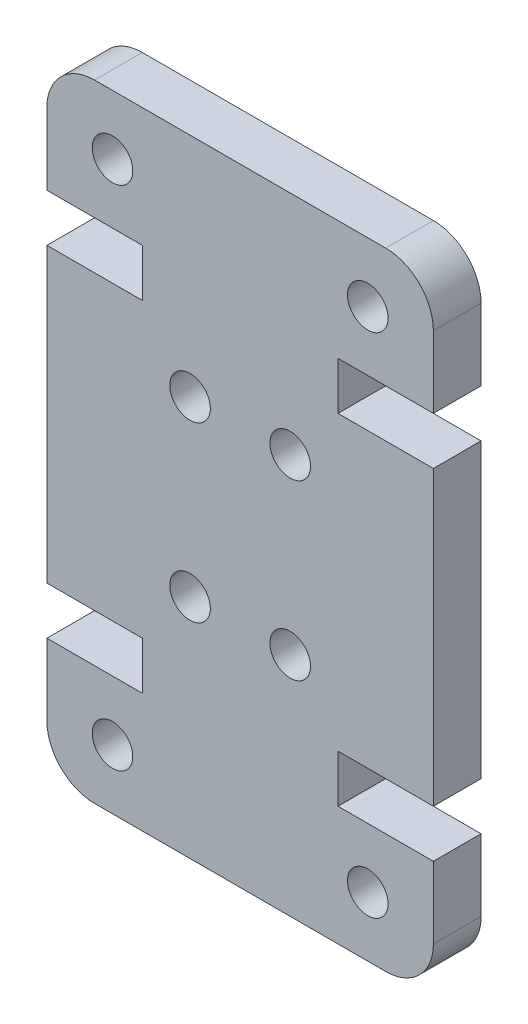
ISO-10303-21;
HEADER;
FILE_DESCRIPTION(('STEP AP214'),'2;1');
FILE_NAME('part.step','',(''),(''),'','','');
FILE_SCHEMA(('AUTOMOTIVE_DESIGN { 1 0 10303 214 1 1 1 1 }'));
ENDSEC;
DATA;
#1=APPLICATION_CONTEXT('core data for automotive mechanical design processes');
#2=APPLICATION_PROTOCOL_DEFINITION('international standard','automotive_design',2000,#1);
#3=PRODUCT_CONTEXT('',#1,'mechanical');
#4=PRODUCT('Part','Part','',(#3));
#5=PRODUCT_RELATED_PRODUCT_CATEGORY('part','',(#4));
#6=PRODUCT_DEFINITION_FORMATION('','',#4);
#7=PRODUCT_DEFINITION_CONTEXT('part definition',#1,'design');
#8=PRODUCT_DEFINITION('design','',#6,#7);
#9=PRODUCT_DEFINITION_SHAPE('','',#8);
#10=(LENGTH_UNIT() NAMED_UNIT(*) SI_UNIT(.MILLI.,.METRE.));
#11=(NAMED_UNIT(*) PLANE_ANGLE_UNIT() SI_UNIT($,.RADIAN.));
#12=(NAMED_UNIT(*) SI_UNIT($,.STERADIAN.) SOLID_ANGLE_UNIT());
#13=UNCERTAINTY_MEASURE_WITH_UNIT(LENGTH_MEASURE(1.E-05),#10,'distance_accuracy_value','');
#14=(GEOMETRIC_REPRESENTATION_CONTEXT(3) GLOBAL_UNCERTAINTY_ASSIGNED_CONTEXT((#13)) GLOBAL_UNIT_ASSIGNED_CONTEXT((#10,
#11,#12)) REPRESENTATION_CONTEXT('',''));
#15=CARTESIAN_POINT('',(0.,0.,0.));
#16=DIRECTION('',(0.,0.,1.));
#17=DIRECTION('',(1.,0.,0.));
#18=AXIS2_PLACEMENT_3D('',#15,#16,#17);
#19=CARTESIAN_POINT('',(14.2,2.,0.));
#20=DIRECTION('',(0.,0.,-1.));
#21=DIRECTION('',(-1.,0.,0.));
#22=AXIS2_PLACEMENT_3D('',#19,#20,#21);
#23=PLANE('',#22);
#24=CARTESIAN_POINT('',(6.00000000000001,9.49999999999963,0.));
#25=DIRECTION('',(0.,0.,1.));
#26=DIRECTION('',(1.,0.,0.));
#27=AXIS2_PLACEMENT_3D('',#24,#25,#26);
#28=CIRCLE('',#27,0.85);
#29=CARTESIAN_POINT('',(6.85,9.49999999999963,0.));
#30=VERTEX_POINT('',#29);
#31=EDGE_CURVE('E359',#30,#30,#28,.T.);
#32=ORIENTED_EDGE('',*,*,#31,.T.);
#33=EDGE_LOOP('',(#32));
#34=FACE_BOUND('',#33,.T.);
#35=CARTESIAN_POINT('',(10.2,16.7600000000004,0.));
#36=DIRECTION('',(0.,0.,1.));
#37=DIRECTION('',(1.,0.,0.));
#38=AXIS2_PLACEMENT_3D('',#35,#36,#37);
#39=CIRCLE('',#38,0.85);
#40=CARTESIAN_POINT('',(11.05,16.7600000000004,0.));
#41=VERTEX_POINT('',#40);
#42=EDGE_CURVE('E353',#41,#41,#39,.T.);
#43=ORIENTED_EDGE('',*,*,#42,.T.);
#44=EDGE_LOOP('',(#43));
#45=FACE_BOUND('',#44,.T.);
#46=CARTESIAN_POINT('',(2.75000000000002,23.7599999999998,0.));
#47=DIRECTION('',(0.,0.,1.));
#48=DIRECTION('',(-1.,0.,0.));
#49=AXIS2_PLACEMENT_3D('',#46,#47,#48);
#50=CIRCLE('',#49,0.85);
#51=CARTESIAN_POINT('',(1.90000000000003,23.7599999999998,0.));
#52=VERTEX_POINT('',#51);
#53=EDGE_CURVE('E347',#52,#52,#50,.T.);
#54=ORIENTED_EDGE('',*,*,#53,.T.);
#55=EDGE_LOOP('',(#54));
#56=FACE_BOUND('',#55,.T.);
#57=CARTESIAN_POINT('',(13.45,2.50000000000017,0.));
#58=DIRECTION('',(0.,0.,1.));
#59=DIRECTION('',(-1.,0.,0.));
#60=AXIS2_PLACEMENT_3D('',#57,#58,#59);
#61=CIRCLE('',#60,0.85);
#62=CARTESIAN_POINT('',(12.6,2.50000000000017,0.));
#63=VERTEX_POINT('',#62);
#64=EDGE_CURVE('E340',#63,#63,#61,.T.);
#65=ORIENTED_EDGE('',*,*,#64,.T.);
#66=EDGE_LOOP('',(#65));
#67=FACE_BOUND('',#66,.T.);
#68=CARTESIAN_POINT('',(14.2,2.,0.));
#69=DIRECTION('',(0.,0.,1.));
#70=DIRECTION('',(-1.,0.,0.));
#71=AXIS2_PLACEMENT_3D('',#68,#69,#70);
#72=CIRCLE('',#71,2.);
#73=CARTESIAN_POINT('',(14.2,0.,0.));
#74=VERTEX_POINT('',#73);
#75=CARTESIAN_POINT('',(16.2,2.,0.));
#76=VERTEX_POINT('',#75);
#77=EDGE_CURVE('E271',#74,#76,#72,.T.);
#78=ORIENTED_EDGE('',*,*,#77,.F.);
#79=DIRECTION('',(1.,0.,0.));
#80=VECTOR('',#79,1.);
#81=CARTESIAN_POINT('',(2.,0.,0.));
#82=LINE('',#81,#80);
#83=CARTESIAN_POINT('',(2.,0.,0.));
#84=VERTEX_POINT('',#83);
#85=EDGE_CURVE('E207',#84,#74,#82,.T.);
#86=ORIENTED_EDGE('',*,*,#85,.F.);
#87=CARTESIAN_POINT('',(2.,2.,0.));
#88=DIRECTION('',(0.,0.,1.));
#89=DIRECTION('',(1.,0.,0.));
#90=AXIS2_PLACEMENT_3D('',#87,#88,#89);
#91=CIRCLE('',#90,2.);
#92=CARTESIAN_POINT('',(0.,2.,0.));
#93=VERTEX_POINT('',#92);
#94=EDGE_CURVE('E213',#93,#84,#91,.T.);
#95=ORIENTED_EDGE('',*,*,#94,.F.);
#96=DIRECTION('',(0.,-1.,0.));
#97=VECTOR('',#96,1.);
#98=CARTESIAN_POINT('',(0.,2.,0.));
#99=LINE('',#98,#97);
#100=CARTESIAN_POINT('',(0.,4.99999999999945,0.));
#101=VERTEX_POINT('',#100);
#102=EDGE_CURVE('E332',#101,#93,#99,.T.);
#103=ORIENTED_EDGE('',*,*,#102,.F.);
#104=DIRECTION('',(-1.,0.,0.));
#105=VECTOR('',#104,1.);
#106=CARTESIAN_POINT('',(4.,4.99999999999945,0.));
#107=LINE('',#106,#105);
#108=CARTESIAN_POINT('',(4.,4.99999999999945,0.));
#109=VERTEX_POINT('',#108);
#110=EDGE_CURVE('E329',#109,#101,#107,.T.);
#111=ORIENTED_EDGE('',*,*,#110,.F.);
#112=DIRECTION('',(0.,-1.,0.));
#113=VECTOR('',#112,1.);
#114=CARTESIAN_POINT('',(4.,6.99999999999945,0.));
#115=LINE('',#114,#113);
#116=CARTESIAN_POINT('',(4.,6.99999999999945,0.));
#117=VERTEX_POINT('',#116);
#118=EDGE_CURVE('E326',#117,#109,#115,.T.);
#119=ORIENTED_EDGE('',*,*,#118,.F.);
#120=DIRECTION('',(1.,0.,0.));
#121=VECTOR('',#120,1.);
#122=CARTESIAN_POINT('',(0.,6.99999999999945,0.));
#123=LINE('',#122,#121);
#124=CARTESIAN_POINT('',(0.,6.99999999999945,0.));
#125=VERTEX_POINT('',#124);
#126=EDGE_CURVE('E323',#125,#117,#123,.T.);
#127=ORIENTED_EDGE('',*,*,#126,.F.);
#128=DIRECTION('',(0.,-1.,0.));
#129=VECTOR('',#128,1.);
#130=CARTESIAN_POINT('',(0.,6.99999999999945,0.));
#131=LINE('',#130,#129);
#132=CARTESIAN_POINT('',(0.,19.2600000000005,0.));
#133=VERTEX_POINT('',#132);
#134=EDGE_CURVE('E320',#133,#125,#131,.T.);
#135=ORIENTED_EDGE('',*,*,#134,.F.);
#136=DIRECTION('',(-1.,0.,0.));
#137=VECTOR('',#136,1.);
#138=CARTESIAN_POINT('',(0.,19.2600000000005,0.));
#139=LINE('',#138,#137);
#140=CARTESIAN_POINT('',(4.,19.2600000000005,0.));
#141=VERTEX_POINT('',#140);
#142=EDGE_CURVE('E317',#141,#133,#139,.T.);
#143=ORIENTED_EDGE('',*,*,#142,.F.);
#144=DIRECTION('',(0.,-1.,0.));
#145=VECTOR('',#144,1.);
#146=CARTESIAN_POINT('',(4.,19.2600000000005,0.));
#147=LINE('',#146,#145);
#148=CARTESIAN_POINT('',(3.99999999999999,21.2600000000005,0.));
#149=VERTEX_POINT('',#148);
#150=EDGE_CURVE('E314',#149,#141,#147,.T.);
#151=ORIENTED_EDGE('',*,*,#150,.F.);
#152=DIRECTION('',(1.,0.,0.));
#153=VECTOR('',#152,1.);
#154=CARTESIAN_POINT('',(3.99999999999999,21.2600000000005,0.));
#155=LINE('',#154,#153);
#156=CARTESIAN_POINT('',(0.,21.2600000000005,0.));
#157=VERTEX_POINT('',#156);
#158=EDGE_CURVE('E311',#157,#149,#155,.T.);
#159=ORIENTED_EDGE('',*,*,#158,.F.);
#160=DIRECTION('',(0.,-1.,0.));
#161=VECTOR('',#160,1.);
#162=CARTESIAN_POINT('',(0.,24.26,0.));
#163=LINE('',#162,#161);
#164=CARTESIAN_POINT('',(0.,24.26,0.));
#165=VERTEX_POINT('',#164);
#166=EDGE_CURVE('E308',#165,#157,#163,.T.);
#167=ORIENTED_EDGE('',*,*,#166,.F.);
#168=CARTESIAN_POINT('',(2.,24.26,0.));
#169=DIRECTION('',(0.,0.,1.));
#170=DIRECTION('',(-1.,0.,0.));
#171=AXIS2_PLACEMENT_3D('',#168,#169,#170);
#172=CIRCLE('',#171,2.);
#173=CARTESIAN_POINT('',(1.99999999999999,26.26,0.));
#174=VERTEX_POINT('',#173);
#175=EDGE_CURVE('E305',#174,#165,#172,.T.);
#176=ORIENTED_EDGE('',*,*,#175,.F.);
#177=DIRECTION('',(-1.,0.,0.));
#178=VECTOR('',#177,1.);
#179=CARTESIAN_POINT('',(1.99999999999999,26.26,0.));
#180=LINE('',#179,#178);
#181=CARTESIAN_POINT('',(14.2,26.26,0.));
#182=VERTEX_POINT('',#181);
#183=EDGE_CURVE('E302',#182,#174,#180,.T.);
#184=ORIENTED_EDGE('',*,*,#183,.F.);
#185=CARTESIAN_POINT('',(14.2,24.26,0.));
#186=DIRECTION('',(0.,0.,1.));
#187=DIRECTION('',(1.,0.,0.));
#188=AXIS2_PLACEMENT_3D('',#185,#186,#187);
#189=CIRCLE('',#188,2.);
#190=CARTESIAN_POINT('',(16.2,24.26,0.));
#191=VERTEX_POINT('',#190);
#192=EDGE_CURVE('E299',#191,#182,#189,.T.);
#193=ORIENTED_EDGE('',*,*,#192,.F.);
#194=DIRECTION('',(0.,1.,0.));
#195=VECTOR('',#194,1.);
#196=CARTESIAN_POINT('',(16.2,24.26,0.));
#197=LINE('',#196,#195);
#198=CARTESIAN_POINT('',(16.2,21.2600000000005,0.));
#199=VERTEX_POINT('',#198);
#200=EDGE_CURVE('E296',#199,#191,#197,.T.);
#201=ORIENTED_EDGE('',*,*,#200,.F.);
#202=DIRECTION('',(1.,0.,0.));
#203=VECTOR('',#202,1.);
#204=CARTESIAN_POINT('',(12.2,21.2600000000005,0.));
#205=LINE('',#204,#203);
#206=CARTESIAN_POINT('',(12.2,21.2600000000005,0.));
#207=VERTEX_POINT('',#206);
#208=EDGE_CURVE('E293',#207,#199,#205,.T.);
#209=ORIENTED_EDGE('',*,*,#208,.F.);
#210=DIRECTION('',(0.,1.,0.));
#211=VECTOR('',#210,1.);
#212=CARTESIAN_POINT('',(12.2,19.2600000000005,0.));
#213=LINE('',#212,#211);
#214=CARTESIAN_POINT('',(12.2,19.2600000000005,0.));
#215=VERTEX_POINT('',#214);
#216=EDGE_CURVE('E290',#215,#207,#213,.T.);
#217=ORIENTED_EDGE('',*,*,#216,.F.);
#218=DIRECTION('',(-1.,0.,0.));
#219=VECTOR('',#218,1.);
#220=CARTESIAN_POINT('',(16.2,19.2600000000005,0.));
#221=LINE('',#220,#219);
#222=CARTESIAN_POINT('',(16.2,19.2600000000005,0.));
#223=VERTEX_POINT('',#222);
#224=EDGE_CURVE('E287',#223,#215,#221,.T.);
#225=ORIENTED_EDGE('',*,*,#224,.F.);
#226=DIRECTION('',(0.,1.,0.));
#227=VECTOR('',#226,1.);
#228=CARTESIAN_POINT('',(16.2,6.99999999999945,0.));
#229=LINE('',#228,#227);
#230=CARTESIAN_POINT('',(16.2,6.99999999999945,0.));
#231=VERTEX_POINT('',#230);
#232=EDGE_CURVE('E284',#231,#223,#229,.T.);
#233=ORIENTED_EDGE('',*,*,#232,.F.);
#234=DIRECTION('',(1.,0.,0.));
#235=VECTOR('',#234,1.);
#236=CARTESIAN_POINT('',(16.2,6.99999999999945,0.));
#237=LINE('',#236,#235);
#238=CARTESIAN_POINT('',(12.2,6.99999999999945,0.));
#239=VERTEX_POINT('',#238);
#240=EDGE_CURVE('E278',#239,#231,#237,.T.);
#241=ORIENTED_EDGE('',*,*,#240,.F.);
#242=DIRECTION('',(0.,1.,0.));
#243=VECTOR('',#242,1.);
#244=CARTESIAN_POINT('',(12.2,6.99999999999945,0.));
#245=LINE('',#244,#243);
#246=CARTESIAN_POINT('',(12.2,4.99999999999945,0.));
#247=VERTEX_POINT('',#246);
#248=EDGE_CURVE('E276',#247,#239,#245,.T.);
#249=ORIENTED_EDGE('',*,*,#248,.F.);
#250=DIRECTION('',(-1.,0.,0.));
#251=VECTOR('',#250,1.);
#252=CARTESIAN_POINT('',(12.2,4.99999999999945,0.));
#253=LINE('',#252,#251);
#254=CARTESIAN_POINT('',(16.2,4.99999999999945,0.));
#255=VERTEX_POINT('',#254);
#256=EDGE_CURVE('E264',#255,#247,#253,.T.);
#257=ORIENTED_EDGE('',*,*,#256,.F.);
#258=DIRECTION('',(0.,1.,0.));
#259=VECTOR('',#258,1.);
#260=CARTESIAN_POINT('',(16.2,2.,0.));
#261=LINE('',#260,#259);
#262=EDGE_CURVE('E268',#76,#255,#261,.T.);
#263=ORIENTED_EDGE('',*,*,#262,.F.);
#264=EDGE_LOOP('',(#78,#86,#95,#103,#111,#119,#127,#135,#143,#151,#159,#167,#176,#184,#193,#201,
#209,#217,#225,#233,#241,#249,#257,#263));
#265=FACE_BOUND('',#264,.T.);
#266=CARTESIAN_POINT('',(10.2,9.49999999999963,0.));
#267=DIRECTION('',(0.,0.,1.));
#268=DIRECTION('',(-1.,0.,0.));
#269=AXIS2_PLACEMENT_3D('',#266,#267,#268);
#270=CIRCLE('',#269,0.85);
#271=CARTESIAN_POINT('',(9.34999999999999,9.49999999999963,0.));
#272=VERTEX_POINT('',#271);
#273=EDGE_CURVE('E342',#272,#272,#270,.T.);
#274=ORIENTED_EDGE('',*,*,#273,.T.);
#275=EDGE_LOOP('',(#274));
#276=FACE_BOUND('',#275,.T.);
#277=CARTESIAN_POINT('',(6.,16.7600000000004,0.));
#278=DIRECTION('',(0.,0.,1.));
#279=DIRECTION('',(-1.,0.,0.));
#280=AXIS2_PLACEMENT_3D('',#277,#278,#279);
#281=CIRCLE('',#280,0.85);
#282=CARTESIAN_POINT('',(5.15,16.7600000000004,0.));
#283=VERTEX_POINT('',#282);
#284=EDGE_CURVE('E350',#283,#283,#281,.T.);
#285=ORIENTED_EDGE('',*,*,#284,.T.);
#286=EDGE_LOOP('',(#285));
#287=FACE_BOUND('',#286,.T.);
#288=CARTESIAN_POINT('',(13.45,23.7599999999998,0.));
#289=DIRECTION('',(0.,0.,1.));
#290=DIRECTION('',(1.,0.,0.));
#291=AXIS2_PLACEMENT_3D('',#288,#289,#290);
#292=CIRCLE('',#291,0.85);
#293=CARTESIAN_POINT('',(14.3,23.7599999999998,0.));
#294=VERTEX_POINT('',#293);
#295=EDGE_CURVE('E356',#294,#294,#292,.T.);
#296=ORIENTED_EDGE('',*,*,#295,.T.);
#297=EDGE_LOOP('',(#296));
#298=FACE_BOUND('',#297,.T.);
#299=CARTESIAN_POINT('',(2.75000000000003,2.50000000000017,0.));
#300=DIRECTION('',(0.,0.,1.));
#301=DIRECTION('',(1.,0.,0.));
#302=AXIS2_PLACEMENT_3D('',#299,#300,#301);
#303=CIRCLE('',#302,0.85);
#304=CARTESIAN_POINT('',(3.60000000000003,2.50000000000017,0.));
#305=VERTEX_POINT('',#304);
#306=EDGE_CURVE('E202',#305,#305,#303,.T.);
#307=ORIENTED_EDGE('',*,*,#306,.T.);
#308=EDGE_LOOP('',(#307));
#309=FACE_BOUND('',#308,.T.);
#310=ADVANCED_FACE('F33',(#34,#45,#56,#67,#265,#276,#287,#298,#309),#23,.T.);
#311=CARTESIAN_POINT('',(14.2,2.,4.));
#312=DIRECTION('',(0.,0.,-1.));
#313=DIRECTION('',(-1.,0.,0.));
#314=AXIS2_PLACEMENT_3D('',#311,#312,#313);
#315=CYLINDRICAL_SURFACE('',#314,2.);
#316=DIRECTION('',(0.,0.,-1.));
#317=VECTOR('',#316,1.);
#318=CARTESIAN_POINT('',(16.2,2.,4.));
#319=LINE('',#318,#317);
#320=CARTESIAN_POINT('',(16.2,2.00000000000001,2.));
#321=VERTEX_POINT('',#320);
#322=EDGE_CURVE('E11',#321,#76,#319,.T.);
#323=ORIENTED_EDGE('',*,*,#322,.F.);
#324=CARTESIAN_POINT('',(14.2,2.,2.));
#325=DIRECTION('',(0.,0.,-1.));
#326=DIRECTION('',(-1.,0.,0.));
#327=AXIS2_PLACEMENT_3D('',#324,#325,#326);
#328=CIRCLE('',#327,2.);
#329=CARTESIAN_POINT('',(14.2,0.,2.));
#330=VERTEX_POINT('',#329);
#331=EDGE_CURVE('E195',#321,#330,#328,.T.);
#332=ORIENTED_EDGE('',*,*,#331,.T.);
#333=DIRECTION('',(0.,0.,-1.));
#334=VECTOR('',#333,1.);
#335=CARTESIAN_POINT('',(14.2,0.,4.));
#336=LINE('',#335,#334);
#337=EDGE_CURVE('E57',#330,#74,#336,.T.);
#338=ORIENTED_EDGE('',*,*,#337,.T.);
#339=ORIENTED_EDGE('',*,*,#77,.T.);
#340=EDGE_LOOP('',(#323,#332,#338,#339));
#341=FACE_BOUND('',#340,.T.);
#342=ADVANCED_FACE('F35',(#341),#315,.T.);
#343=CARTESIAN_POINT('',(16.2,2.,4.));
#344=DIRECTION('',(-1.,0.,0.));
#345=DIRECTION('',(0.,0.,1.));
#346=AXIS2_PLACEMENT_3D('',#343,#344,#345);
#347=PLANE('',#346);
#348=DIRECTION('',(0.,0.,-1.));
#349=VECTOR('',#348,1.);
#350=CARTESIAN_POINT('',(16.2,4.99999999999945,4.));
#351=LINE('',#350,#349);
#352=CARTESIAN_POINT('',(16.2,4.99999999999945,2.));
#353=VERTEX_POINT('',#352);
#354=EDGE_CURVE('E42',#353,#255,#351,.T.);
#355=ORIENTED_EDGE('',*,*,#354,.F.);
#356=DIRECTION('',(0.,1.,0.));
#357=VECTOR('',#356,1.);
#358=CARTESIAN_POINT('',(16.2,26.26,2.));
#359=LINE('',#358,#357);
#360=EDGE_CURVE('E432',#321,#353,#359,.T.);
#361=ORIENTED_EDGE('',*,*,#360,.F.);
#362=ORIENTED_EDGE('',*,*,#322,.T.);
#363=ORIENTED_EDGE('',*,*,#262,.T.);
#364=EDGE_LOOP('',(#355,#361,#362,#363));
#365=FACE_BOUND('',#364,.T.);
#366=ADVANCED_FACE('F269',(#365),#347,.F.);
#367=CARTESIAN_POINT('',(12.2,4.99999999999945,4.));
#368=DIRECTION('',(0.,-1.,0.));
#369=DIRECTION('',(0.,0.,-1.));
#370=AXIS2_PLACEMENT_3D('',#367,#368,#369);
#371=PLANE('',#370);
#372=DIRECTION('',(0.,0.,-1.));
#373=VECTOR('',#372,1.);
#374=CARTESIAN_POINT('',(12.2,4.99999999999945,4.));
#375=LINE('',#374,#373);
#376=CARTESIAN_POINT('',(12.2,4.99999999999945,2.));
#377=VERTEX_POINT('',#376);
#378=EDGE_CURVE('E254',#377,#247,#375,.T.);
#379=ORIENTED_EDGE('',*,*,#378,.F.);
#380=DIRECTION('',(1.,0.,0.));
#381=VECTOR('',#380,1.);
#382=CARTESIAN_POINT('',(12.2,4.99999999999945,2.));
#383=LINE('',#382,#381);
#384=EDGE_CURVE('E203',#377,#353,#383,.T.);
#385=ORIENTED_EDGE('',*,*,#384,.T.);
#386=ORIENTED_EDGE('',*,*,#354,.T.);
#387=ORIENTED_EDGE('',*,*,#256,.T.);
#388=EDGE_LOOP('',(#379,#385,#386,#387));
#389=FACE_BOUND('',#388,.T.);
#390=ADVANCED_FACE('F262',(#389),#371,.F.);
#391=CARTESIAN_POINT('',(12.2,6.99999999999945,4.));
#392=DIRECTION('',(-1.,0.,0.));
#393=DIRECTION('',(0.,-1.,0.));
#394=AXIS2_PLACEMENT_3D('',#391,#392,#393);
#395=PLANE('',#394);
#396=DIRECTION('',(0.,0.,-1.));
#397=VECTOR('',#396,1.);
#398=CARTESIAN_POINT('',(12.2,6.99999999999945,4.));
#399=LINE('',#398,#397);
#400=CARTESIAN_POINT('',(12.2,6.99999999999945,2.));
#401=VERTEX_POINT('',#400);
#402=EDGE_CURVE('E252',#401,#239,#399,.T.);
#403=ORIENTED_EDGE('',*,*,#402,.F.);
#404=DIRECTION('',(0.,-1.,0.));
#405=VECTOR('',#404,1.);
#406=CARTESIAN_POINT('',(12.2,6.99999999999945,2.));
#407=LINE('',#406,#405);
#408=EDGE_CURVE('E365',#401,#377,#407,.T.);
#409=ORIENTED_EDGE('',*,*,#408,.T.);
#410=ORIENTED_EDGE('',*,*,#378,.T.);
#411=ORIENTED_EDGE('',*,*,#248,.T.);
#412=EDGE_LOOP('',(#403,#409,#410,#411));
#413=FACE_BOUND('',#412,.T.);
#414=ADVANCED_FACE('F437',(#413),#395,.F.);
#415=CARTESIAN_POINT('',(16.2,6.99999999999945,4.));
#416=DIRECTION('',(0.,1.,0.));
#417=DIRECTION('',(-1.,0.,0.));
#418=AXIS2_PLACEMENT_3D('',#415,#416,#417);
#419=PLANE('',#418);
#420=DIRECTION('',(0.,0.,-1.));
#421=VECTOR('',#420,1.);
#422=CARTESIAN_POINT('',(16.2,6.99999999999945,4.));
#423=LINE('',#422,#421);
#424=CARTESIAN_POINT('',(16.2,6.99999999999945,2.));
#425=VERTEX_POINT('',#424);
#426=EDGE_CURVE('E250',#425,#231,#423,.T.);
#427=ORIENTED_EDGE('',*,*,#426,.F.);
#428=DIRECTION('',(-1.,0.,0.));
#429=VECTOR('',#428,1.);
#430=CARTESIAN_POINT('',(16.2,6.99999999999945,2.));
#431=LINE('',#430,#429);
#432=EDGE_CURVE('E368',#425,#401,#431,.T.);
#433=ORIENTED_EDGE('',*,*,#432,.T.);
#434=ORIENTED_EDGE('',*,*,#402,.T.);
#435=ORIENTED_EDGE('',*,*,#240,.T.);
#436=EDGE_LOOP('',(#427,#433,#434,#435));
#437=FACE_BOUND('',#436,.T.);
#438=ADVANCED_FACE('F440',(#437),#419,.F.);
#439=CARTESIAN_POINT('',(16.2,6.99999999999945,4.));
#440=DIRECTION('',(-1.,0.,0.));
#441=DIRECTION('',(0.,0.,1.));
#442=AXIS2_PLACEMENT_3D('',#439,#440,#441);
#443=PLANE('',#442);
#444=DIRECTION('',(0.,0.,-1.));
#445=VECTOR('',#444,1.);
#446=CARTESIAN_POINT('',(16.2,19.2600000000005,4.));
#447=LINE('',#446,#445);
#448=CARTESIAN_POINT('',(16.2,19.2600000000005,2.));
#449=VERTEX_POINT('',#448);
#450=EDGE_CURVE('E248',#449,#223,#447,.T.);
#451=ORIENTED_EDGE('',*,*,#450,.F.);
#452=EDGE_CURVE('E433',#425,#449,#359,.T.);
#453=ORIENTED_EDGE('',*,*,#452,.F.);
#454=ORIENTED_EDGE('',*,*,#426,.T.);
#455=ORIENTED_EDGE('',*,*,#232,.T.);
#456=EDGE_LOOP('',(#451,#453,#454,#455));
#457=FACE_BOUND('',#456,.T.);
#458=ADVANCED_FACE('F445',(#457),#443,.F.);
#459=CARTESIAN_POINT('',(16.2,19.2600000000005,4.));
#460=DIRECTION('',(0.,-1.,0.));
#461=DIRECTION('',(0.,0.,-1.));
#462=AXIS2_PLACEMENT_3D('',#459,#460,#461);
#463=PLANE('',#462);
#464=DIRECTION('',(0.,0.,-1.));
#465=VECTOR('',#464,1.);
#466=CARTESIAN_POINT('',(12.2,19.2600000000005,4.));
#467=LINE('',#466,#465);
#468=CARTESIAN_POINT('',(12.2,19.2600000000005,2.));
#469=VERTEX_POINT('',#468);
#470=EDGE_CURVE('E246',#469,#215,#467,.T.);
#471=ORIENTED_EDGE('',*,*,#470,.F.);
#472=DIRECTION('',(1.,0.,0.));
#473=VECTOR('',#472,1.);
#474=CARTESIAN_POINT('',(16.2,19.2600000000005,2.));
#475=LINE('',#474,#473);
#476=EDGE_CURVE('E371',#469,#449,#475,.T.);
#477=ORIENTED_EDGE('',*,*,#476,.T.);
#478=ORIENTED_EDGE('',*,*,#450,.T.);
#479=ORIENTED_EDGE('',*,*,#224,.T.);
#480=EDGE_LOOP('',(#471,#477,#478,#479));
#481=FACE_BOUND('',#480,.T.);
#482=ADVANCED_FACE('F449',(#481),#463,.F.);
#483=CARTESIAN_POINT('',(12.2,19.2600000000005,4.));
#484=DIRECTION('',(-1.,0.,0.));
#485=DIRECTION('',(0.,-1.,0.));
#486=AXIS2_PLACEMENT_3D('',#483,#484,#485);
#487=PLANE('',#486);
#488=DIRECTION('',(0.,0.,-1.));
#489=VECTOR('',#488,1.);
#490=CARTESIAN_POINT('',(12.2,21.2600000000005,4.));
#491=LINE('',#490,#489);
#492=CARTESIAN_POINT('',(12.2,21.2600000000005,2.));
#493=VERTEX_POINT('',#492);
#494=EDGE_CURVE('E244',#493,#207,#491,.T.);
#495=ORIENTED_EDGE('',*,*,#494,.F.);
#496=DIRECTION('',(0.,-1.,0.));
#497=VECTOR('',#496,1.);
#498=CARTESIAN_POINT('',(12.2,19.2600000000005,2.));
#499=LINE('',#498,#497);
#500=EDGE_CURVE('E374',#493,#469,#499,.T.);
#501=ORIENTED_EDGE('',*,*,#500,.T.);
#502=ORIENTED_EDGE('',*,*,#470,.T.);
#503=ORIENTED_EDGE('',*,*,#216,.T.);
#504=EDGE_LOOP('',(#495,#501,#502,#503));
#505=FACE_BOUND('',#504,.T.);
#506=ADVANCED_FACE('F453',(#505),#487,.F.);
#507=CARTESIAN_POINT('',(12.2,21.2600000000005,4.));
#508=DIRECTION('',(0.,1.,0.));
#509=DIRECTION('',(0.,0.,1.));
#510=AXIS2_PLACEMENT_3D('',#507,#508,#509);
#511=PLANE('',#510);
#512=DIRECTION('',(0.,0.,-1.));
#513=VECTOR('',#512,1.);
#514=CARTESIAN_POINT('',(16.2,21.2600000000005,4.));
#515=LINE('',#514,#513);
#516=CARTESIAN_POINT('',(16.2,21.2600000000005,2.));
#517=VERTEX_POINT('',#516);
#518=EDGE_CURVE('E242',#517,#199,#515,.T.);
#519=ORIENTED_EDGE('',*,*,#518,.F.);
#520=DIRECTION('',(-1.,0.,0.));
#521=VECTOR('',#520,1.);
#522=CARTESIAN_POINT('',(12.2,21.2600000000005,2.));
#523=LINE('',#522,#521);
#524=EDGE_CURVE('E377',#517,#493,#523,.T.);
#525=ORIENTED_EDGE('',*,*,#524,.T.);
#526=ORIENTED_EDGE('',*,*,#494,.T.);
#527=ORIENTED_EDGE('',*,*,#208,.T.);
#528=EDGE_LOOP('',(#519,#525,#526,#527));
#529=FACE_BOUND('',#528,.T.);
#530=ADVANCED_FACE('F457',(#529),#511,.F.);
#531=CARTESIAN_POINT('',(16.2,24.26,4.));
#532=DIRECTION('',(-1.,0.,0.));
#533=DIRECTION('',(0.,0.,1.));
#534=AXIS2_PLACEMENT_3D('',#531,#532,#533);
#535=PLANE('',#534);
#536=DIRECTION('',(0.,0.,-1.));
#537=VECTOR('',#536,1.);
#538=CARTESIAN_POINT('',(16.2,24.26,4.));
#539=LINE('',#538,#537);
#540=CARTESIAN_POINT('',(16.2,24.26,2.));
#541=VERTEX_POINT('',#540);
#542=EDGE_CURVE('E240',#541,#191,#539,.T.);
#543=ORIENTED_EDGE('',*,*,#542,.F.);
#544=EDGE_CURVE('E199',#517,#541,#359,.T.);
#545=ORIENTED_EDGE('',*,*,#544,.F.);
#546=ORIENTED_EDGE('',*,*,#518,.T.);
#547=ORIENTED_EDGE('',*,*,#200,.T.);
#548=EDGE_LOOP('',(#543,#545,#546,#547));
#549=FACE_BOUND('',#548,.T.);
#550=ADVANCED_FACE('F461',(#549),#535,.F.);
#551=CARTESIAN_POINT('',(14.2,24.26,4.));
#552=DIRECTION('',(0.,0.,-1.));
#553=DIRECTION('',(-1.,0.,0.));
#554=AXIS2_PLACEMENT_3D('',#551,#552,#553);
#555=CYLINDRICAL_SURFACE('',#554,2.);
#556=DIRECTION('',(0.,0.,-1.));
#557=VECTOR('',#556,1.);
#558=CARTESIAN_POINT('',(14.2,26.26,4.));
#559=LINE('',#558,#557);
#560=CARTESIAN_POINT('',(14.2,26.26,2.));
#561=VERTEX_POINT('',#560);
#562=EDGE_CURVE('E238',#561,#182,#559,.T.);
#563=ORIENTED_EDGE('',*,*,#562,.F.);
#564=CARTESIAN_POINT('',(14.2,24.26,2.));
#565=DIRECTION('',(0.,0.,-1.));
#566=DIRECTION('',(-1.,0.,0.));
#567=AXIS2_PLACEMENT_3D('',#564,#565,#566);
#568=CIRCLE('',#567,2.);
#569=EDGE_CURVE('E380',#561,#541,#568,.T.);
#570=ORIENTED_EDGE('',*,*,#569,.T.);
#571=ORIENTED_EDGE('',*,*,#542,.T.);
#572=ORIENTED_EDGE('',*,*,#192,.T.);
#573=EDGE_LOOP('',(#563,#570,#571,#572));
#574=FACE_BOUND('',#573,.T.);
#575=ADVANCED_FACE('F465',(#574),#555,.T.);
#576=CARTESIAN_POINT('',(1.99999999999999,26.26,4.));
#577=DIRECTION('',(0.,-1.,0.));
#578=DIRECTION('',(0.,0.,-1.));
#579=AXIS2_PLACEMENT_3D('',#576,#577,#578);
#580=PLANE('',#579);
#581=DIRECTION('',(0.,0.,-1.));
#582=VECTOR('',#581,1.);
#583=CARTESIAN_POINT('',(1.99999999999999,26.26,4.));
#584=LINE('',#583,#582);
#585=CARTESIAN_POINT('',(2.,26.26,2.));
#586=VERTEX_POINT('',#585);
#587=EDGE_CURVE('E236',#586,#174,#584,.T.);
#588=ORIENTED_EDGE('',*,*,#587,.F.);
#589=DIRECTION('',(-1.,0.,0.));
#590=VECTOR('',#589,1.);
#591=CARTESIAN_POINT('',(0.,26.26,2.));
#592=LINE('',#591,#590);
#593=EDGE_CURVE('E429',#561,#586,#592,.T.);
#594=ORIENTED_EDGE('',*,*,#593,.F.);
#595=ORIENTED_EDGE('',*,*,#562,.T.);
#596=ORIENTED_EDGE('',*,*,#183,.T.);
#597=EDGE_LOOP('',(#588,#594,#595,#596));
#598=FACE_BOUND('',#597,.T.);
#599=ADVANCED_FACE('F470',(#598),#580,.F.);
#600=CARTESIAN_POINT('',(2.,24.26,4.));
#601=DIRECTION('',(0.,0.,-1.));
#602=DIRECTION('',(-1.,0.,0.));
#603=AXIS2_PLACEMENT_3D('',#600,#601,#602);
#604=CYLINDRICAL_SURFACE('',#603,2.);
#605=DIRECTION('',(0.,0.,-1.));
#606=VECTOR('',#605,1.);
#607=CARTESIAN_POINT('',(0.,24.26,4.));
#608=LINE('',#607,#606);
#609=CARTESIAN_POINT('',(0.,24.26,2.));
#610=VERTEX_POINT('',#609);
#611=EDGE_CURVE('E234',#610,#165,#608,.T.);
#612=ORIENTED_EDGE('',*,*,#611,.F.);
#613=CARTESIAN_POINT('',(2.,24.26,2.));
#614=DIRECTION('',(0.,0.,-1.));
#615=DIRECTION('',(-1.,0.,0.));
#616=AXIS2_PLACEMENT_3D('',#613,#614,#615);
#617=CIRCLE('',#616,2.);
#618=EDGE_CURVE('E383',#610,#586,#617,.T.);
#619=ORIENTED_EDGE('',*,*,#618,.T.);
#620=ORIENTED_EDGE('',*,*,#587,.T.);
#621=ORIENTED_EDGE('',*,*,#175,.T.);
#622=EDGE_LOOP('',(#612,#619,#620,#621));
#623=FACE_BOUND('',#622,.T.);
#624=ADVANCED_FACE('F474',(#623),#604,.T.);
#625=CARTESIAN_POINT('',(0.,24.26,4.));
#626=DIRECTION('',(1.,0.,0.));
#627=DIRECTION('',(0.,1.,0.));
#628=AXIS2_PLACEMENT_3D('',#625,#626,#627);
#629=PLANE('',#628);
#630=DIRECTION('',(0.,0.,-1.));
#631=VECTOR('',#630,1.);
#632=CARTESIAN_POINT('',(0.,21.2600000000005,4.));
#633=LINE('',#632,#631);
#634=CARTESIAN_POINT('',(0.,21.2600000000005,2.));
#635=VERTEX_POINT('',#634);
#636=EDGE_CURVE('E232',#635,#157,#633,.T.);
#637=ORIENTED_EDGE('',*,*,#636,.F.);
#638=DIRECTION('',(0.,-1.,0.));
#639=VECTOR('',#638,1.);
#640=CARTESIAN_POINT('',(0.,0.,2.));
#641=LINE('',#640,#639);
#642=EDGE_CURVE('E430',#610,#635,#641,.T.);
#643=ORIENTED_EDGE('',*,*,#642,.F.);
#644=ORIENTED_EDGE('',*,*,#611,.T.);
#645=ORIENTED_EDGE('',*,*,#166,.T.);
#646=EDGE_LOOP('',(#637,#643,#644,#645));
#647=FACE_BOUND('',#646,.T.);
#648=ADVANCED_FACE('F479',(#647),#629,.F.);
#649=CARTESIAN_POINT('',(3.99999999999999,21.2600000000005,4.));
#650=DIRECTION('',(0.,1.,0.));
#651=DIRECTION('',(-1.,0.,0.));
#652=AXIS2_PLACEMENT_3D('',#649,#650,#651);
#653=PLANE('',#652);
#654=DIRECTION('',(0.,0.,-1.));
#655=VECTOR('',#654,1.);
#656=CARTESIAN_POINT('',(3.99999999999999,21.2600000000005,4.));
#657=LINE('',#656,#655);
#658=CARTESIAN_POINT('',(3.99999999999999,21.2600000000005,2.));
#659=VERTEX_POINT('',#658);
#660=EDGE_CURVE('E230',#659,#149,#657,.T.);
#661=ORIENTED_EDGE('',*,*,#660,.F.);
#662=DIRECTION('',(-1.,0.,0.));
#663=VECTOR('',#662,1.);
#664=CARTESIAN_POINT('',(3.99999999999999,21.2600000000005,2.));
#665=LINE('',#664,#663);
#666=EDGE_CURVE('E386',#659,#635,#665,.T.);
#667=ORIENTED_EDGE('',*,*,#666,.T.);
#668=ORIENTED_EDGE('',*,*,#636,.T.);
#669=ORIENTED_EDGE('',*,*,#158,.T.);
#670=EDGE_LOOP('',(#661,#667,#668,#669));
#671=FACE_BOUND('',#670,.T.);
#672=ADVANCED_FACE('F690',(#671),#653,.F.);
#673=CARTESIAN_POINT('',(4.,19.2600000000005,4.));
#674=DIRECTION('',(1.,0.,0.));
#675=DIRECTION('',(0.,1.,0.));
#676=AXIS2_PLACEMENT_3D('',#673,#674,#675);
#677=PLANE('',#676);
#678=DIRECTION('',(0.,0.,-1.));
#679=VECTOR('',#678,1.);
#680=CARTESIAN_POINT('',(4.,19.2600000000005,4.));
#681=LINE('',#680,#679);
#682=CARTESIAN_POINT('',(4.,19.2600000000005,2.));
#683=VERTEX_POINT('',#682);
#684=EDGE_CURVE('E228',#683,#141,#681,.T.);
#685=ORIENTED_EDGE('',*,*,#684,.F.);
#686=DIRECTION('',(0.,1.,0.));
#687=VECTOR('',#686,1.);
#688=CARTESIAN_POINT('',(4.,19.2600000000005,2.));
#689=LINE('',#688,#687);
#690=EDGE_CURVE('E389',#683,#659,#689,.T.);
#691=ORIENTED_EDGE('',*,*,#690,.T.);
#692=ORIENTED_EDGE('',*,*,#660,.T.);
#693=ORIENTED_EDGE('',*,*,#150,.T.);
#694=EDGE_LOOP('',(#685,#691,#692,#693));
#695=FACE_BOUND('',#694,.T.);
#696=ADVANCED_FACE('F681',(#695),#677,.F.);
#697=CARTESIAN_POINT('',(0.,19.2600000000005,4.));
#698=DIRECTION('',(0.,-1.,0.));
#699=DIRECTION('',(1.,0.,0.));
#700=AXIS2_PLACEMENT_3D('',#697,#698,#699);
#701=PLANE('',#700);
#702=DIRECTION('',(0.,0.,-1.));
#703=VECTOR('',#702,1.);
#704=CARTESIAN_POINT('',(0.,19.2600000000005,4.));
#705=LINE('',#704,#703);
#706=CARTESIAN_POINT('',(0.,19.2600000000005,2.));
#707=VERTEX_POINT('',#706);
#708=EDGE_CURVE('E226',#707,#133,#705,.T.);
#709=ORIENTED_EDGE('',*,*,#708,.F.);
#710=DIRECTION('',(1.,0.,0.));
#711=VECTOR('',#710,1.);
#712=CARTESIAN_POINT('',(0.,19.2600000000005,2.));
#713=LINE('',#712,#711);
#714=EDGE_CURVE('E392',#707,#683,#713,.T.);
#715=ORIENTED_EDGE('',*,*,#714,.T.);
#716=ORIENTED_EDGE('',*,*,#684,.T.);
#717=ORIENTED_EDGE('',*,*,#142,.T.);
#718=EDGE_LOOP('',(#709,#715,#716,#717));
#719=FACE_BOUND('',#718,.T.);
#720=ADVANCED_FACE('F673',(#719),#701,.F.);
#721=CARTESIAN_POINT('',(0.,6.99999999999945,4.));
#722=DIRECTION('',(1.,0.,0.));
#723=DIRECTION('',(0.,1.,0.));
#724=AXIS2_PLACEMENT_3D('',#721,#722,#723);
#725=PLANE('',#724);
#726=DIRECTION('',(0.,0.,-1.));
#727=VECTOR('',#726,1.);
#728=CARTESIAN_POINT('',(0.,6.99999999999945,4.));
#729=LINE('',#728,#727);
#730=CARTESIAN_POINT('',(0.,6.99999999999945,2.));
#731=VERTEX_POINT('',#730);
#732=EDGE_CURVE('E224',#731,#125,#729,.T.);
#733=ORIENTED_EDGE('',*,*,#732,.F.);
#734=EDGE_CURVE('E428',#707,#731,#641,.T.);
#735=ORIENTED_EDGE('',*,*,#734,.F.);
#736=ORIENTED_EDGE('',*,*,#708,.T.);
#737=ORIENTED_EDGE('',*,*,#134,.T.);
#738=EDGE_LOOP('',(#733,#735,#736,#737));
#739=FACE_BOUND('',#738,.T.);
#740=ADVANCED_FACE('F488',(#739),#725,.F.);
#741=CARTESIAN_POINT('',(0.,6.99999999999945,4.));
#742=DIRECTION('',(0.,1.,0.));
#743=DIRECTION('',(0.,0.,1.));
#744=AXIS2_PLACEMENT_3D('',#741,#742,#743);
#745=PLANE('',#744);
#746=DIRECTION('',(0.,0.,-1.));
#747=VECTOR('',#746,1.);
#748=CARTESIAN_POINT('',(4.,6.99999999999945,4.));
#749=LINE('',#748,#747);
#750=CARTESIAN_POINT('',(4.,6.99999999999945,2.));
#751=VERTEX_POINT('',#750);
#752=EDGE_CURVE('E222',#751,#117,#749,.T.);
#753=ORIENTED_EDGE('',*,*,#752,.F.);
#754=DIRECTION('',(-1.,0.,0.));
#755=VECTOR('',#754,1.);
#756=CARTESIAN_POINT('',(0.,6.99999999999945,2.));
#757=LINE('',#756,#755);
#758=EDGE_CURVE('E395',#751,#731,#757,.T.);
#759=ORIENTED_EDGE('',*,*,#758,.T.);
#760=ORIENTED_EDGE('',*,*,#732,.T.);
#761=ORIENTED_EDGE('',*,*,#126,.T.);
#762=EDGE_LOOP('',(#753,#759,#760,#761));
#763=FACE_BOUND('',#762,.T.);
#764=ADVANCED_FACE('F487',(#763),#745,.F.);
#765=CARTESIAN_POINT('',(4.,6.99999999999945,4.));
#766=DIRECTION('',(1.,0.,0.));
#767=DIRECTION('',(0.,0.,-1.));
#768=AXIS2_PLACEMENT_3D('',#765,#766,#767);
#769=PLANE('',#768);
#770=DIRECTION('',(0.,0.,-1.));
#771=VECTOR('',#770,1.);
#772=CARTESIAN_POINT('',(4.,4.99999999999945,4.));
#773=LINE('',#772,#771);
#774=CARTESIAN_POINT('',(4.,4.99999999999945,2.));
#775=VERTEX_POINT('',#774);
#776=EDGE_CURVE('E220',#775,#109,#773,.T.);
#777=ORIENTED_EDGE('',*,*,#776,.F.);
#778=DIRECTION('',(0.,1.,0.));
#779=VECTOR('',#778,1.);
#780=CARTESIAN_POINT('',(4.,6.99999999999945,2.));
#781=LINE('',#780,#779);
#782=EDGE_CURVE('E398',#775,#751,#781,.T.);
#783=ORIENTED_EDGE('',*,*,#782,.T.);
#784=ORIENTED_EDGE('',*,*,#752,.T.);
#785=ORIENTED_EDGE('',*,*,#118,.T.);
#786=EDGE_LOOP('',(#777,#783,#784,#785));
#787=FACE_BOUND('',#786,.T.);
#788=ADVANCED_FACE('F496',(#787),#769,.F.);
#789=CARTESIAN_POINT('',(4.,4.99999999999945,4.));
#790=DIRECTION('',(0.,-1.,0.));
#791=DIRECTION('',(0.,0.,-1.));
#792=AXIS2_PLACEMENT_3D('',#789,#790,#791);
#793=PLANE('',#792);
#794=DIRECTION('',(0.,0.,-1.));
#795=VECTOR('',#794,1.);
#796=CARTESIAN_POINT('',(0.,4.99999999999945,4.));
#797=LINE('',#796,#795);
#798=CARTESIAN_POINT('',(0.,4.99999999999945,2.));
#799=VERTEX_POINT('',#798);
#800=EDGE_CURVE('E218',#799,#101,#797,.T.);
#801=ORIENTED_EDGE('',*,*,#800,.F.);
#802=DIRECTION('',(1.,0.,0.));
#803=VECTOR('',#802,1.);
#804=CARTESIAN_POINT('',(4.,4.99999999999945,2.));
#805=LINE('',#804,#803);
#806=EDGE_CURVE('E401',#799,#775,#805,.T.);
#807=ORIENTED_EDGE('',*,*,#806,.T.);
#808=ORIENTED_EDGE('',*,*,#776,.T.);
#809=ORIENTED_EDGE('',*,*,#110,.T.);
#810=EDGE_LOOP('',(#801,#807,#808,#809));
#811=FACE_BOUND('',#810,.T.);
#812=ADVANCED_FACE('F500',(#811),#793,.F.);
#813=CARTESIAN_POINT('',(0.,2.,4.));
#814=DIRECTION('',(1.,0.,0.));
#815=DIRECTION('',(0.,0.,-1.));
#816=AXIS2_PLACEMENT_3D('',#813,#814,#815);
#817=PLANE('',#816);
#818=DIRECTION('',(0.,0.,-1.));
#819=VECTOR('',#818,1.);
#820=CARTESIAN_POINT('',(0.,2.,4.));
#821=LINE('',#820,#819);
#822=CARTESIAN_POINT('',(0.,2.,2.));
#823=VERTEX_POINT('',#822);
#824=EDGE_CURVE('E211',#823,#93,#821,.T.);
#825=ORIENTED_EDGE('',*,*,#824,.F.);
#826=EDGE_CURVE('E426',#799,#823,#641,.T.);
#827=ORIENTED_EDGE('',*,*,#826,.F.);
#828=ORIENTED_EDGE('',*,*,#800,.T.);
#829=ORIENTED_EDGE('',*,*,#102,.T.);
#830=EDGE_LOOP('',(#825,#827,#828,#829));
#831=FACE_BOUND('',#830,.T.);
#832=ADVANCED_FACE('F502',(#831),#817,.F.);
#833=CARTESIAN_POINT('',(2.,2.,4.));
#834=DIRECTION('',(0.,0.,-1.));
#835=DIRECTION('',(-1.,0.,0.));
#836=AXIS2_PLACEMENT_3D('',#833,#834,#835);
#837=CYLINDRICAL_SURFACE('',#836,2.);
#838=DIRECTION('',(0.,0.,-1.));
#839=VECTOR('',#838,1.);
#840=CARTESIAN_POINT('',(2.,0.,4.));
#841=LINE('',#840,#839);
#842=CARTESIAN_POINT('',(2.,0.,2.));
#843=VERTEX_POINT('',#842);
#844=EDGE_CURVE('E209',#843,#84,#841,.T.);
#845=ORIENTED_EDGE('',*,*,#844,.F.);
#846=CARTESIAN_POINT('',(2.,2.,2.));
#847=DIRECTION('',(0.,0.,-1.));
#848=DIRECTION('',(-1.,0.,0.));
#849=AXIS2_PLACEMENT_3D('',#846,#847,#848);
#850=CIRCLE('',#849,2.);
#851=EDGE_CURVE('E49',#843,#823,#850,.T.);
#852=ORIENTED_EDGE('',*,*,#851,.T.);
#853=ORIENTED_EDGE('',*,*,#824,.T.);
#854=ORIENTED_EDGE('',*,*,#94,.T.);
#855=EDGE_LOOP('',(#845,#852,#853,#854));
#856=FACE_BOUND('',#855,.T.);
#857=ADVANCED_FACE('F337',(#856),#837,.T.);
#858=CARTESIAN_POINT('',(2.,0.,4.));
#859=DIRECTION('',(0.,1.,0.));
#860=DIRECTION('',(-1.,0.,0.));
#861=AXIS2_PLACEMENT_3D('',#858,#859,#860);
#862=PLANE('',#861);
#863=ORIENTED_EDGE('',*,*,#337,.F.);
#864=DIRECTION('',(1.,0.,0.));
#865=VECTOR('',#864,1.);
#866=CARTESIAN_POINT('',(16.2,0.,2.));
#867=LINE('',#866,#865);
#868=EDGE_CURVE('E193',#843,#330,#867,.T.);
#869=ORIENTED_EDGE('',*,*,#868,.F.);
#870=ORIENTED_EDGE('',*,*,#844,.T.);
#871=ORIENTED_EDGE('',*,*,#85,.T.);
#872=EDGE_LOOP('',(#863,#869,#870,#871));
#873=FACE_BOUND('',#872,.T.);
#874=ADVANCED_FACE('F205',(#873),#862,.F.);
#875=CARTESIAN_POINT('',(13.45,2.50000000000017,4.));
#876=DIRECTION('',(0.,0.,-1.));
#877=DIRECTION('',(-1.,0.,0.));
#878=AXIS2_PLACEMENT_3D('',#875,#876,#877);
#879=CYLINDRICAL_SURFACE('',#878,0.85);
#880=CARTESIAN_POINT('',(13.45,2.50000000000017,2.));
#881=DIRECTION('',(0.,0.,-1.));
#882=DIRECTION('',(-1.,0.,0.));
#883=AXIS2_PLACEMENT_3D('',#880,#881,#882);
#884=CIRCLE('',#883,0.85);
#885=CARTESIAN_POINT('',(12.6,2.50000000000017,2.));
#886=VERTEX_POINT('',#885);
#887=EDGE_CURVE('E405',#886,#886,#884,.T.);
#888=ORIENTED_EDGE('',*,*,#887,.F.);
#889=EDGE_LOOP('',(#888));
#890=FACE_BOUND('',#889,.T.);
#891=ORIENTED_EDGE('',*,*,#64,.F.);
#892=EDGE_LOOP('',(#891));
#893=FACE_BOUND('',#892,.T.);
#894=ADVANCED_FACE('F520',(#890,#893),#879,.F.);
#895=CARTESIAN_POINT('',(10.2,9.49999999999963,4.));
#896=DIRECTION('',(0.,0.,-1.));
#897=DIRECTION('',(-1.,0.,0.));
#898=AXIS2_PLACEMENT_3D('',#895,#896,#897);
#899=CYLINDRICAL_SURFACE('',#898,0.85);
#900=CARTESIAN_POINT('',(10.2,9.49999999999963,2.));
#901=DIRECTION('',(0.,0.,-1.));
#902=DIRECTION('',(-1.,0.,0.));
#903=AXIS2_PLACEMENT_3D('',#900,#901,#902);
#904=CIRCLE('',#903,0.85);
#905=CARTESIAN_POINT('',(9.34999999999999,9.49999999999963,2.));
#906=VERTEX_POINT('',#905);
#907=EDGE_CURVE('E408',#906,#906,#904,.T.);
#908=ORIENTED_EDGE('',*,*,#907,.F.);
#909=EDGE_LOOP('',(#908));
#910=FACE_BOUND('',#909,.T.);
#911=ORIENTED_EDGE('',*,*,#273,.F.);
#912=EDGE_LOOP('',(#911));
#913=FACE_BOUND('',#912,.T.);
#914=ADVANCED_FACE('F526',(#910,#913),#899,.F.);
#915=CARTESIAN_POINT('',(2.75000000000002,23.7599999999998,4.));
#916=DIRECTION('',(0.,0.,-1.));
#917=DIRECTION('',(-1.,0.,0.));
#918=AXIS2_PLACEMENT_3D('',#915,#916,#917);
#919=CYLINDRICAL_SURFACE('',#918,0.85);
#920=CARTESIAN_POINT('',(2.75000000000002,23.7599999999998,2.));
#921=DIRECTION('',(0.,0.,-1.));
#922=DIRECTION('',(-1.,0.,0.));
#923=AXIS2_PLACEMENT_3D('',#920,#921,#922);
#924=CIRCLE('',#923,0.85);
#925=CARTESIAN_POINT('',(1.90000000000003,23.7599999999998,2.));
#926=VERTEX_POINT('',#925);
#927=EDGE_CURVE('E411',#926,#926,#924,.T.);
#928=ORIENTED_EDGE('',*,*,#927,.F.);
#929=EDGE_LOOP('',(#928));
#930=FACE_BOUND('',#929,.T.);
#931=ORIENTED_EDGE('',*,*,#53,.F.);
#932=EDGE_LOOP('',(#931));
#933=FACE_BOUND('',#932,.T.);
#934=ADVANCED_FACE('F531',(#930,#933),#919,.F.);
#935=CARTESIAN_POINT('',(6.,16.7600000000004,4.));
#936=DIRECTION('',(0.,0.,-1.));
#937=DIRECTION('',(-1.,0.,0.));
#938=AXIS2_PLACEMENT_3D('',#935,#936,#937);
#939=CYLINDRICAL_SURFACE('',#938,0.85);
#940=CARTESIAN_POINT('',(6.,16.7600000000004,2.));
#941=DIRECTION('',(0.,0.,-1.));
#942=DIRECTION('',(-1.,0.,0.));
#943=AXIS2_PLACEMENT_3D('',#940,#941,#942);
#944=CIRCLE('',#943,0.85);
#945=CARTESIAN_POINT('',(5.15,16.7600000000004,2.));
#946=VERTEX_POINT('',#945);
#947=EDGE_CURVE('E414',#946,#946,#944,.T.);
#948=ORIENTED_EDGE('',*,*,#947,.F.);
#949=EDGE_LOOP('',(#948));
#950=FACE_BOUND('',#949,.T.);
#951=ORIENTED_EDGE('',*,*,#284,.F.);
#952=EDGE_LOOP('',(#951));
#953=FACE_BOUND('',#952,.T.);
#954=ADVANCED_FACE('F575',(#950,#953),#939,.F.);
#955=CARTESIAN_POINT('',(10.2,16.7600000000004,4.));
#956=DIRECTION('',(0.,0.,-1.));
#957=DIRECTION('',(-1.,0.,0.));
#958=AXIS2_PLACEMENT_3D('',#955,#956,#957);
#959=CYLINDRICAL_SURFACE('',#958,0.85);
#960=CARTESIAN_POINT('',(10.2,16.7600000000004,2.));
#961=DIRECTION('',(0.,0.,-1.));
#962=DIRECTION('',(-1.,0.,0.));
#963=AXIS2_PLACEMENT_3D('',#960,#961,#962);
#964=CIRCLE('',#963,0.85);
#965=CARTESIAN_POINT('',(9.34999999999999,16.7600000000004,2.));
#966=VERTEX_POINT('',#965);
#967=EDGE_CURVE('E417',#966,#966,#964,.T.);
#968=ORIENTED_EDGE('',*,*,#967,.F.);
#969=EDGE_LOOP('',(#968));
#970=FACE_BOUND('',#969,.T.);
#971=ORIENTED_EDGE('',*,*,#42,.F.);
#972=EDGE_LOOP('',(#971));
#973=FACE_BOUND('',#972,.T.);
#974=ADVANCED_FACE('F571',(#970,#973),#959,.F.);
#975=CARTESIAN_POINT('',(13.45,23.7599999999998,4.));
#976=DIRECTION('',(0.,0.,-1.));
#977=DIRECTION('',(-1.,0.,0.));
#978=AXIS2_PLACEMENT_3D('',#975,#976,#977);
#979=CYLINDRICAL_SURFACE('',#978,0.85);
#980=CARTESIAN_POINT('',(13.45,23.7599999999998,2.));
#981=DIRECTION('',(0.,0.,-1.));
#982=DIRECTION('',(-1.,0.,0.));
#983=AXIS2_PLACEMENT_3D('',#980,#981,#982);
#984=CIRCLE('',#983,0.85);
#985=CARTESIAN_POINT('',(12.6,23.7599999999998,2.));
#986=VERTEX_POINT('',#985);
#987=EDGE_CURVE('E420',#986,#986,#984,.T.);
#988=ORIENTED_EDGE('',*,*,#987,.F.);
#989=EDGE_LOOP('',(#988));
#990=FACE_BOUND('',#989,.T.);
#991=ORIENTED_EDGE('',*,*,#295,.F.);
#992=EDGE_LOOP('',(#991));
#993=FACE_BOUND('',#992,.T.);
#994=ADVANCED_FACE('F565',(#990,#993),#979,.F.);
#995=CARTESIAN_POINT('',(6.00000000000001,9.49999999999963,4.));
#996=DIRECTION('',(0.,0.,-1.));
#997=DIRECTION('',(-1.,0.,0.));
#998=AXIS2_PLACEMENT_3D('',#995,#996,#997);
#999=CYLINDRICAL_SURFACE('',#998,0.85);
#1000=CARTESIAN_POINT('',(6.00000000000001,9.49999999999963,2.));
#1001=DIRECTION('',(0.,0.,-1.));
#1002=DIRECTION('',(-1.,0.,0.));
#1003=AXIS2_PLACEMENT_3D('',#1000,#1001,#1002);
#1004=CIRCLE('',#1003,0.85);
#1005=CARTESIAN_POINT('',(5.15000000000001,9.49999999999963,2.));
#1006=VERTEX_POINT('',#1005);
#1007=EDGE_CURVE('E423',#1006,#1006,#1004,.T.);
#1008=ORIENTED_EDGE('',*,*,#1007,.F.);
#1009=EDGE_LOOP('',(#1008));
#1010=FACE_BOUND('',#1009,.T.);
#1011=ORIENTED_EDGE('',*,*,#31,.F.);
#1012=EDGE_LOOP('',(#1011));
#1013=FACE_BOUND('',#1012,.T.);
#1014=ADVANCED_FACE('F558',(#1010,#1013),#999,.F.);
#1015=CARTESIAN_POINT('',(2.75000000000003,2.50000000000017,4.));
#1016=DIRECTION('',(0.,0.,-1.));
#1017=DIRECTION('',(-1.,0.,0.));
#1018=AXIS2_PLACEMENT_3D('',#1015,#1016,#1017);
#1019=CYLINDRICAL_SURFACE('',#1018,0.85);
#1020=CARTESIAN_POINT('',(2.75000000000003,2.50000000000017,2.));
#1021=DIRECTION('',(0.,0.,-1.));
#1022=DIRECTION('',(-1.,0.,0.));
#1023=AXIS2_PLACEMENT_3D('',#1020,#1021,#1022);
#1024=CIRCLE('',#1023,0.85);
#1025=CARTESIAN_POINT('',(1.90000000000003,2.50000000000017,2.));
#1026=VERTEX_POINT('',#1025);
#1027=EDGE_CURVE('E37',#1026,#1026,#1024,.T.);
#1028=ORIENTED_EDGE('',*,*,#1027,.F.);
#1029=EDGE_LOOP('',(#1028));
#1030=FACE_BOUND('',#1029,.T.);
#1031=ORIENTED_EDGE('',*,*,#306,.F.);
#1032=EDGE_LOOP('',(#1031));
#1033=FACE_BOUND('',#1032,.T.);
#1034=ADVANCED_FACE('F540',(#1030,#1033),#1019,.F.);
#1035=CARTESIAN_POINT('',(0.,0.,2.));
#1036=DIRECTION('',(0.,0.,-1.));
#1037=DIRECTION('',(-1.,0.,0.));
#1038=AXIS2_PLACEMENT_3D('',#1035,#1036,#1037);
#1039=PLANE('',#1038);
#1040=ORIENTED_EDGE('',*,*,#887,.T.);
#1041=EDGE_LOOP('',(#1040));
#1042=FACE_BOUND('',#1041,.T.);
#1043=ORIENTED_EDGE('',*,*,#907,.T.);
#1044=EDGE_LOOP('',(#1043));
#1045=FACE_BOUND('',#1044,.T.);
#1046=ORIENTED_EDGE('',*,*,#927,.T.);
#1047=EDGE_LOOP('',(#1046));
#1048=FACE_BOUND('',#1047,.T.);
#1049=ORIENTED_EDGE('',*,*,#947,.T.);
#1050=EDGE_LOOP('',(#1049));
#1051=FACE_BOUND('',#1050,.T.);
#1052=ORIENTED_EDGE('',*,*,#967,.T.);
#1053=EDGE_LOOP('',(#1052));
#1054=FACE_BOUND('',#1053,.T.);
#1055=ORIENTED_EDGE('',*,*,#987,.T.);
#1056=EDGE_LOOP('',(#1055));
#1057=FACE_BOUND('',#1056,.T.);
#1058=ORIENTED_EDGE('',*,*,#1007,.T.);
#1059=EDGE_LOOP('',(#1058));
#1060=FACE_BOUND('',#1059,.T.);
#1061=ORIENTED_EDGE('',*,*,#1027,.T.);
#1062=EDGE_LOOP('',(#1061));
#1063=FACE_BOUND('',#1062,.T.);
#1064=ORIENTED_EDGE('',*,*,#360,.T.);
#1065=ORIENTED_EDGE('',*,*,#384,.F.);
#1066=ORIENTED_EDGE('',*,*,#408,.F.);
#1067=ORIENTED_EDGE('',*,*,#432,.F.);
#1068=ORIENTED_EDGE('',*,*,#452,.T.);
#1069=ORIENTED_EDGE('',*,*,#476,.F.);
#1070=ORIENTED_EDGE('',*,*,#500,.F.);
#1071=ORIENTED_EDGE('',*,*,#524,.F.);
#1072=ORIENTED_EDGE('',*,*,#544,.T.);
#1073=ORIENTED_EDGE('',*,*,#569,.F.);
#1074=ORIENTED_EDGE('',*,*,#593,.T.);
#1075=ORIENTED_EDGE('',*,*,#618,.F.);
#1076=ORIENTED_EDGE('',*,*,#642,.T.);
#1077=ORIENTED_EDGE('',*,*,#666,.F.);
#1078=ORIENTED_EDGE('',*,*,#690,.F.);
#1079=ORIENTED_EDGE('',*,*,#714,.F.);
#1080=ORIENTED_EDGE('',*,*,#734,.T.);
#1081=ORIENTED_EDGE('',*,*,#758,.F.);
#1082=ORIENTED_EDGE('',*,*,#782,.F.);
#1083=ORIENTED_EDGE('',*,*,#806,.F.);
#1084=ORIENTED_EDGE('',*,*,#826,.T.);
#1085=ORIENTED_EDGE('',*,*,#851,.F.);
#1086=ORIENTED_EDGE('',*,*,#868,.T.);
#1087=ORIENTED_EDGE('',*,*,#331,.F.);
#1088=EDGE_LOOP('',(#1064,#1065,#1066,#1067,#1068,#1069,#1070,#1071,#1072,#1073,#1074,#1075,
#1076,#1077,#1078,#1079,#1080,#1081,#1082,#1083,#1084,#1085,#1086,#1087));
#1089=FACE_BOUND('',#1088,.T.);
#1090=ADVANCED_FACE('F194',(#1042,#1045,#1048,#1051,#1054,#1057,#1060,#1063,#1089),#1039,.F.);
#1091=CLOSED_SHELL('',(#310,#342,#366,#390,#414,#438,#458,#482,#506,#530,#550,#575,#599,#624,
#648,#672,#696,#720,#740,#764,#788,#812,#832,#857,#874,#894,#914,#934,#954,#974,#994,#1014,
#1034,#1090));
#1092=MANIFOLD_SOLID_BREP('B2',#1091);
#1093=ADVANCED_BREP_SHAPE_REPRESENTATION('',(#18,#1092),#14);
#1094=SHAPE_DEFINITION_REPRESENTATION(#9,#1093);
ENDSEC;
END-ISO-10303-21;
